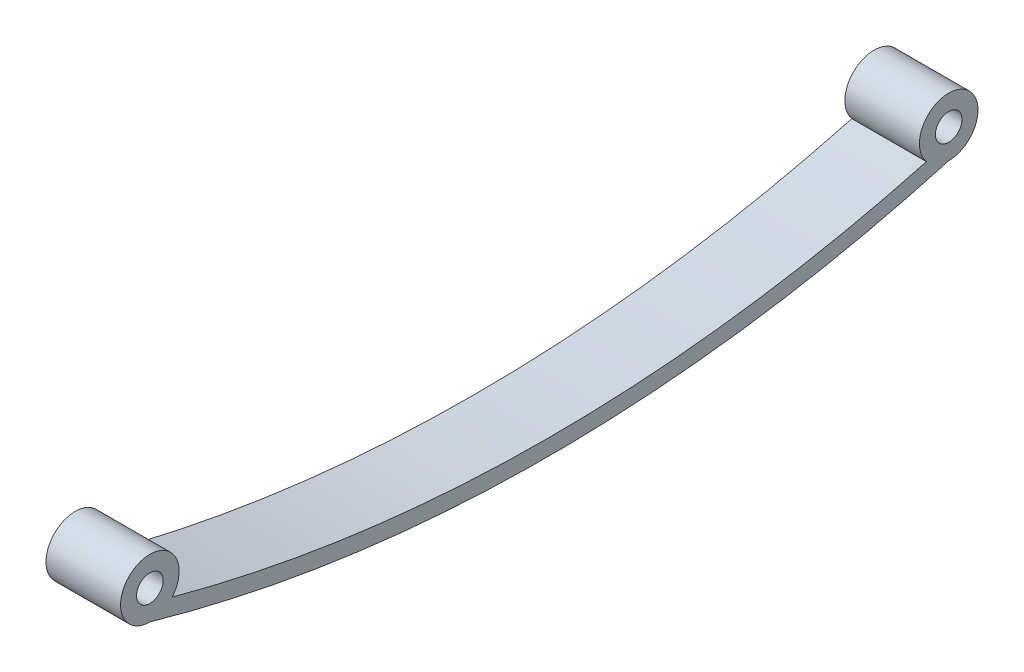
ISO-10303-21;
HEADER;
FILE_DESCRIPTION(('STEP AP214'),'2;1');
FILE_NAME('part.step','',(''),(''),'','','');
FILE_SCHEMA(('AUTOMOTIVE_DESIGN { 1 0 10303 214 1 1 1 1 }'));
ENDSEC;
DATA;
#1=APPLICATION_CONTEXT('core data for automotive mechanical design processes');
#2=APPLICATION_PROTOCOL_DEFINITION('international standard','automotive_design',2000,#1);
#3=PRODUCT_CONTEXT('',#1,'mechanical');
#4=PRODUCT('Part','Part','',(#3));
#5=PRODUCT_RELATED_PRODUCT_CATEGORY('part','',(#4));
#6=PRODUCT_DEFINITION_FORMATION('','',#4);
#7=PRODUCT_DEFINITION_CONTEXT('part definition',#1,'design');
#8=PRODUCT_DEFINITION('design','',#6,#7);
#9=PRODUCT_DEFINITION_SHAPE('','',#8);
#10=(LENGTH_UNIT() NAMED_UNIT(*) SI_UNIT(.MILLI.,.METRE.));
#11=(NAMED_UNIT(*) PLANE_ANGLE_UNIT() SI_UNIT($,.RADIAN.));
#12=(NAMED_UNIT(*) SI_UNIT($,.STERADIAN.) SOLID_ANGLE_UNIT());
#13=UNCERTAINTY_MEASURE_WITH_UNIT(LENGTH_MEASURE(1.E-05),#10,'distance_accuracy_value','');
#14=(GEOMETRIC_REPRESENTATION_CONTEXT(3) GLOBAL_UNCERTAINTY_ASSIGNED_CONTEXT((#13)) GLOBAL_UNIT_ASSIGNED_CONTEXT((#10,
#11,#12)) REPRESENTATION_CONTEXT('',''));
#15=CARTESIAN_POINT('',(0.,0.,0.));
#16=DIRECTION('',(0.,0.,1.));
#17=DIRECTION('',(1.,0.,0.));
#18=AXIS2_PLACEMENT_3D('',#15,#16,#17);
#19=CARTESIAN_POINT('',(7.,64.2767857142857,-18.75));
#20=DIRECTION('',(1.,0.,0.));
#21=DIRECTION('',(0.,0.,-1.));
#22=AXIS2_PLACEMENT_3D('',#19,#20,#21);
#23=PLANE('',#22);
#24=CARTESIAN_POINT('',(7.,0.,37.5));
#25=DIRECTION('',(1.,0.,0.));
#26=DIRECTION('',(0.,0.,-1.));
#27=AXIS2_PLACEMENT_3D('',#24,#25,#26);
#28=CIRCLE('',#27,1.25);
#29=CARTESIAN_POINT('',(7.,0.,36.25));
#30=VERTEX_POINT('',#29);
#31=EDGE_CURVE('E99',#30,#30,#28,.T.);
#32=ORIENTED_EDGE('',*,*,#31,.F.);
#33=EDGE_LOOP('',(#32));
#34=FACE_BOUND('',#33,.T.);
#35=CARTESIAN_POINT('',(7.,128.553571428571,0.));
#36=DIRECTION('',(1.,0.,0.));
#37=DIRECTION('',(0.,0.,-1.));
#38=AXIS2_PLACEMENT_3D('',#35,#36,#37);
#39=CIRCLE('',#38,136.553571428571);
#40=CARTESIAN_POINT('',(7.,-2.74999999999999,37.5));
#41=VERTEX_POINT('',#40);
#42=CARTESIAN_POINT('',(7.,-2.74999999999999,-37.5));
#43=VERTEX_POINT('',#42);
#44=EDGE_CURVE('E84',#41,#43,#39,.T.);
#45=ORIENTED_EDGE('',*,*,#44,.T.);
#46=CARTESIAN_POINT('',(7.,0.,-37.5));
#47=DIRECTION('',(1.,0.,0.));
#48=DIRECTION('',(0.,0.,-1.));
#49=AXIS2_PLACEMENT_3D('',#46,#47,#48);
#50=CIRCLE('',#49,2.74999999999999);
#51=CARTESIAN_POINT('',(7.,-1.7775025598952,-35.4016709863403));
#52=VERTEX_POINT('',#51);
#53=EDGE_CURVE('E79',#43,#52,#50,.T.);
#54=ORIENTED_EDGE('',*,*,#53,.T.);
#55=CARTESIAN_POINT('',(7.,128.553571428571,0.));
#56=DIRECTION('',(-1.,0.,0.));
#57=DIRECTION('',(0.,0.,-1.));
#58=AXIS2_PLACEMENT_3D('',#55,#56,#57);
#59=CIRCLE('',#58,135.053571428571);
#60=CARTESIAN_POINT('',(7.,-1.77750255989517,35.4016709863403));
#61=VERTEX_POINT('',#60);
#62=EDGE_CURVE('E82',#52,#61,#59,.T.);
#63=ORIENTED_EDGE('',*,*,#62,.T.);
#64=CARTESIAN_POINT('',(7.,0.,37.5));
#65=DIRECTION('',(1.,0.,0.));
#66=DIRECTION('',(0.,0.,-1.));
#67=AXIS2_PLACEMENT_3D('',#64,#65,#66);
#68=CIRCLE('',#67,2.74999999999999);
#69=EDGE_CURVE('E49',#61,#41,#68,.T.);
#70=ORIENTED_EDGE('',*,*,#69,.T.);
#71=EDGE_LOOP('',(#45,#54,#63,#70));
#72=FACE_BOUND('',#71,.T.);
#73=CARTESIAN_POINT('',(7.,0.,-37.5));
#74=DIRECTION('',(1.,0.,0.));
#75=DIRECTION('',(0.,0.,-1.));
#76=AXIS2_PLACEMENT_3D('',#73,#74,#75);
#77=CIRCLE('',#76,1.25);
#78=CARTESIAN_POINT('',(7.,0.,-38.75));
#79=VERTEX_POINT('',#78);
#80=EDGE_CURVE('E114',#79,#79,#77,.T.);
#81=ORIENTED_EDGE('',*,*,#80,.F.);
#82=EDGE_LOOP('',(#81));
#83=FACE_BOUND('',#82,.T.);
#84=ADVANCED_FACE('F32',(#34,#72,#83),#23,.T.);
#85=CARTESIAN_POINT('',(0.,64.2767857142857,-18.75));
#86=DIRECTION('',(1.,0.,0.));
#87=DIRECTION('',(0.,0.,-1.));
#88=AXIS2_PLACEMENT_3D('',#85,#86,#87);
#89=PLANE('',#88);
#90=CARTESIAN_POINT('',(0.,128.553571428571,0.));
#91=DIRECTION('',(1.,0.,0.));
#92=DIRECTION('',(0.,0.,-1.));
#93=AXIS2_PLACEMENT_3D('',#90,#91,#92);
#94=CIRCLE('',#93,136.553571428571);
#95=CARTESIAN_POINT('',(0.,-2.74999999999999,37.5));
#96=VERTEX_POINT('',#95);
#97=CARTESIAN_POINT('',(0.,-2.74999999999999,-37.5));
#98=VERTEX_POINT('',#97);
#99=EDGE_CURVE('E96',#96,#98,#94,.T.);
#100=ORIENTED_EDGE('',*,*,#99,.F.);
#101=CARTESIAN_POINT('',(0.,0.,37.5));
#102=DIRECTION('',(1.,0.,0.));
#103=DIRECTION('',(0.,0.,-1.));
#104=AXIS2_PLACEMENT_3D('',#101,#102,#103);
#105=CIRCLE('',#104,2.74999999999999);
#106=CARTESIAN_POINT('',(0.,-1.77750255989517,35.4016709863403));
#107=VERTEX_POINT('',#106);
#108=EDGE_CURVE('E72',#107,#96,#105,.T.);
#109=ORIENTED_EDGE('',*,*,#108,.F.);
#110=CARTESIAN_POINT('',(0.,128.553571428571,0.));
#111=DIRECTION('',(-1.,0.,0.));
#112=DIRECTION('',(0.,0.,-1.));
#113=AXIS2_PLACEMENT_3D('',#110,#111,#112);
#114=CIRCLE('',#113,135.053571428571);
#115=CARTESIAN_POINT('',(0.,-1.7775025598952,-35.4016709863403));
#116=VERTEX_POINT('',#115);
#117=EDGE_CURVE('E66',#116,#107,#114,.T.);
#118=ORIENTED_EDGE('',*,*,#117,.F.);
#119=CARTESIAN_POINT('',(0.,0.,-37.5));
#120=DIRECTION('',(1.,0.,0.));
#121=DIRECTION('',(0.,0.,-1.));
#122=AXIS2_PLACEMENT_3D('',#119,#120,#121);
#123=CIRCLE('',#122,2.74999999999999);
#124=EDGE_CURVE('E88',#98,#116,#123,.T.);
#125=ORIENTED_EDGE('',*,*,#124,.F.);
#126=EDGE_LOOP('',(#100,#109,#118,#125));
#127=FACE_BOUND('',#126,.T.);
#128=CARTESIAN_POINT('',(0.,0.,37.5));
#129=DIRECTION('',(1.,0.,0.));
#130=DIRECTION('',(0.,0.,-1.));
#131=AXIS2_PLACEMENT_3D('',#128,#129,#130);
#132=CIRCLE('',#131,1.25);
#133=CARTESIAN_POINT('',(0.,0.,36.25));
#134=VERTEX_POINT('',#133);
#135=EDGE_CURVE('E111',#134,#134,#132,.T.);
#136=ORIENTED_EDGE('',*,*,#135,.T.);
#137=EDGE_LOOP('',(#136));
#138=FACE_BOUND('',#137,.T.);
#139=CARTESIAN_POINT('',(0.,0.,-37.5));
#140=DIRECTION('',(1.,0.,0.));
#141=DIRECTION('',(0.,0.,-1.));
#142=AXIS2_PLACEMENT_3D('',#139,#140,#141);
#143=CIRCLE('',#142,1.25);
#144=CARTESIAN_POINT('',(0.,0.,-38.75));
#145=VERTEX_POINT('',#144);
#146=EDGE_CURVE('E117',#145,#145,#143,.T.);
#147=ORIENTED_EDGE('',*,*,#146,.T.);
#148=EDGE_LOOP('',(#147));
#149=FACE_BOUND('',#148,.T.);
#150=ADVANCED_FACE('F107',(#127,#138,#149),#89,.F.);
#151=CARTESIAN_POINT('',(7.,128.553571428571,0.));
#152=DIRECTION('',(-1.,0.,0.));
#153=DIRECTION('',(0.,0.,1.));
#154=AXIS2_PLACEMENT_3D('',#151,#152,#153);
#155=CYLINDRICAL_SURFACE('',#154,136.553571428571);
#156=ORIENTED_EDGE('',*,*,#99,.T.);
#157=DIRECTION('',(-1.,0.,0.));
#158=VECTOR('',#157,1.);
#159=CARTESIAN_POINT('',(7.,-2.74999999999999,-37.5));
#160=LINE('',#159,#158);
#161=EDGE_CURVE('E11',#43,#98,#160,.T.);
#162=ORIENTED_EDGE('',*,*,#161,.F.);
#163=ORIENTED_EDGE('',*,*,#44,.F.);
#164=DIRECTION('',(-1.,0.,0.));
#165=VECTOR('',#164,1.);
#166=CARTESIAN_POINT('',(7.,-2.74999999999999,37.5));
#167=LINE('',#166,#165);
#168=EDGE_CURVE('E92',#41,#96,#167,.T.);
#169=ORIENTED_EDGE('',*,*,#168,.T.);
#170=EDGE_LOOP('',(#156,#162,#163,#169));
#171=FACE_BOUND('',#170,.T.);
#172=ADVANCED_FACE('F34',(#171),#155,.T.);
#173=CARTESIAN_POINT('',(7.,0.,-37.5));
#174=DIRECTION('',(-1.,0.,0.));
#175=DIRECTION('',(0.,0.,1.));
#176=AXIS2_PLACEMENT_3D('',#173,#174,#175);
#177=CYLINDRICAL_SURFACE('',#176,2.74999999999999);
#178=ORIENTED_EDGE('',*,*,#124,.T.);
#179=DIRECTION('',(-1.,0.,0.));
#180=VECTOR('',#179,1.);
#181=CARTESIAN_POINT('',(7.,-1.7775025598952,-35.4016709863403));
#182=LINE('',#181,#180);
#183=EDGE_CURVE('E41',#52,#116,#182,.T.);
#184=ORIENTED_EDGE('',*,*,#183,.F.);
#185=ORIENTED_EDGE('',*,*,#53,.F.);
#186=ORIENTED_EDGE('',*,*,#161,.T.);
#187=EDGE_LOOP('',(#178,#184,#185,#186));
#188=FACE_BOUND('',#187,.T.);
#189=ADVANCED_FACE('F87',(#188),#177,.T.);
#190=CARTESIAN_POINT('',(7.,128.553571428571,0.));
#191=DIRECTION('',(-1.,0.,0.));
#192=DIRECTION('',(0.,0.,1.));
#193=AXIS2_PLACEMENT_3D('',#190,#191,#192);
#194=CYLINDRICAL_SURFACE('',#193,135.053571428571);
#195=ORIENTED_EDGE('',*,*,#117,.T.);
#196=DIRECTION('',(-1.,0.,0.));
#197=VECTOR('',#196,1.);
#198=CARTESIAN_POINT('',(7.,-1.77750255989517,35.4016709863403));
#199=LINE('',#198,#197);
#200=EDGE_CURVE('E89',#61,#107,#199,.T.);
#201=ORIENTED_EDGE('',*,*,#200,.F.);
#202=ORIENTED_EDGE('',*,*,#62,.F.);
#203=ORIENTED_EDGE('',*,*,#183,.T.);
#204=EDGE_LOOP('',(#195,#201,#202,#203));
#205=FACE_BOUND('',#204,.T.);
#206=ADVANCED_FACE('F90',(#205),#194,.F.);
#207=CARTESIAN_POINT('',(7.,0.,37.5));
#208=DIRECTION('',(-1.,0.,0.));
#209=DIRECTION('',(0.,0.,1.));
#210=AXIS2_PLACEMENT_3D('',#207,#208,#209);
#211=CYLINDRICAL_SURFACE('',#210,2.74999999999999);
#212=ORIENTED_EDGE('',*,*,#108,.T.);
#213=ORIENTED_EDGE('',*,*,#168,.F.);
#214=ORIENTED_EDGE('',*,*,#69,.F.);
#215=ORIENTED_EDGE('',*,*,#200,.T.);
#216=EDGE_LOOP('',(#212,#213,#214,#215));
#217=FACE_BOUND('',#216,.T.);
#218=ADVANCED_FACE('F104',(#217),#211,.T.);
#219=CARTESIAN_POINT('',(7.,0.,37.5));
#220=DIRECTION('',(-1.,0.,0.));
#221=DIRECTION('',(0.,0.,1.));
#222=AXIS2_PLACEMENT_3D('',#219,#220,#221);
#223=CYLINDRICAL_SURFACE('',#222,1.25);
#224=ORIENTED_EDGE('',*,*,#31,.T.);
#225=EDGE_LOOP('',(#224));
#226=FACE_BOUND('',#225,.T.);
#227=ORIENTED_EDGE('',*,*,#135,.F.);
#228=EDGE_LOOP('',(#227));
#229=FACE_BOUND('',#228,.T.);
#230=ADVANCED_FACE('F134',(#226,#229),#223,.F.);
#231=CARTESIAN_POINT('',(7.,0.,-37.5));
#232=DIRECTION('',(-1.,0.,0.));
#233=DIRECTION('',(0.,0.,1.));
#234=AXIS2_PLACEMENT_3D('',#231,#232,#233);
#235=CYLINDRICAL_SURFACE('',#234,1.25);
#236=ORIENTED_EDGE('',*,*,#80,.T.);
#237=EDGE_LOOP('',(#236));
#238=FACE_BOUND('',#237,.T.);
#239=ORIENTED_EDGE('',*,*,#146,.F.);
#240=EDGE_LOOP('',(#239));
#241=FACE_BOUND('',#240,.T.);
#242=ADVANCED_FACE('F123',(#238,#241),#235,.F.);
#243=CLOSED_SHELL('',(#84,#150,#172,#189,#206,#218,#230,#242));
#244=MANIFOLD_SOLID_BREP('B2',#243);
#245=ADVANCED_BREP_SHAPE_REPRESENTATION('',(#18,#244),#14);
#246=SHAPE_DEFINITION_REPRESENTATION(#9,#245);
ENDSEC;
END-ISO-10303-21;
